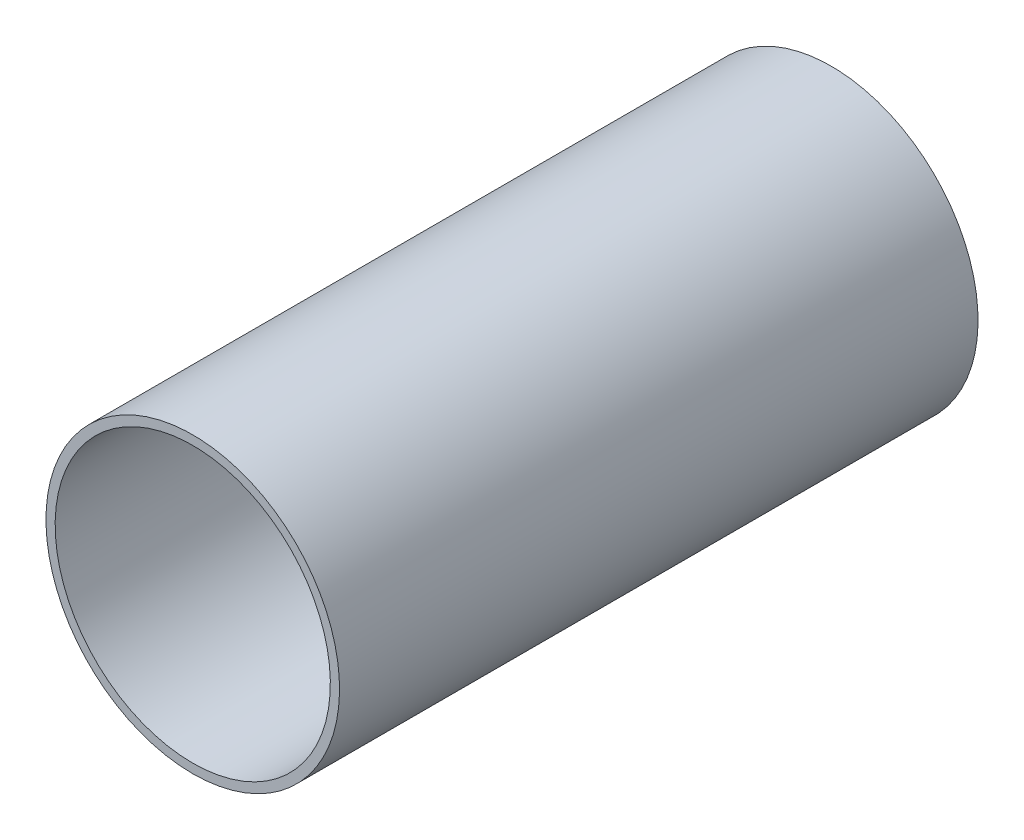
ISO-10303-21;
HEADER;
FILE_DESCRIPTION(('STEP AP214'),'2;1');
FILE_NAME('part.step','',(''),(''),'','','');
FILE_SCHEMA(('AUTOMOTIVE_DESIGN { 1 0 10303 214 1 1 1 1 }'));
ENDSEC;
DATA;
#1=APPLICATION_CONTEXT('core data for automotive mechanical design processes');
#2=APPLICATION_PROTOCOL_DEFINITION('international standard','automotive_design',2000,#1);
#3=PRODUCT_CONTEXT('',#1,'mechanical');
#4=PRODUCT('Part','Part','',(#3));
#5=PRODUCT_RELATED_PRODUCT_CATEGORY('part','',(#4));
#6=PRODUCT_DEFINITION_FORMATION('','',#4);
#7=PRODUCT_DEFINITION_CONTEXT('part definition',#1,'design');
#8=PRODUCT_DEFINITION('design','',#6,#7);
#9=PRODUCT_DEFINITION_SHAPE('','',#8);
#10=(LENGTH_UNIT() NAMED_UNIT(*) SI_UNIT(.MILLI.,.METRE.));
#11=(NAMED_UNIT(*) PLANE_ANGLE_UNIT() SI_UNIT($,.RADIAN.));
#12=(NAMED_UNIT(*) SI_UNIT($,.STERADIAN.) SOLID_ANGLE_UNIT());
#13=UNCERTAINTY_MEASURE_WITH_UNIT(LENGTH_MEASURE(1.E-05),#10,'distance_accuracy_value','');
#14=(GEOMETRIC_REPRESENTATION_CONTEXT(3) GLOBAL_UNCERTAINTY_ASSIGNED_CONTEXT((#13)) GLOBAL_UNIT_ASSIGNED_CONTEXT((#10,
#11,#12)) REPRESENTATION_CONTEXT('',''));
#15=CARTESIAN_POINT('',(0.,0.,0.));
#16=DIRECTION('',(0.,0.,1.));
#17=DIRECTION('',(1.,0.,0.));
#18=AXIS2_PLACEMENT_3D('',#15,#16,#17);
#19=CARTESIAN_POINT('',(137.16,-80.772,-0.045));
#20=DIRECTION('',(0.,0.,-1.));
#21=DIRECTION('',(0.,-1.,0.));
#22=AXIS2_PLACEMENT_3D('',#19,#20,#21);
#23=CYLINDRICAL_SURFACE('',#22,0.375);
#24=CARTESIAN_POINT('',(137.16,-80.772,-0.035));
#25=DIRECTION('',(0.,0.,-1.));
#26=DIRECTION('',(0.,-1.,0.));
#27=AXIS2_PLACEMENT_3D('',#24,#25,#26);
#28=CIRCLE('',#27,0.375);
#29=CARTESIAN_POINT('',(137.16,-81.147,-0.035));
#30=VERTEX_POINT('',#29);
#31=EDGE_CURVE('E54',#30,#30,#28,.T.);
#32=ORIENTED_EDGE('',*,*,#31,.T.);
#33=DIRECTION('',(0.,0.,1.));
#34=VECTOR('',#33,1.);
#35=CARTESIAN_POINT('',(137.16,-81.147,-0.045));
#36=LINE('',#35,#34);
#37=CARTESIAN_POINT('',(137.16,-81.147,1.705));
#38=VERTEX_POINT('',#37);
#39=EDGE_CURVE('E11',#30,#38,#36,.T.);
#40=ORIENTED_EDGE('',*,*,#39,.T.);
#41=CARTESIAN_POINT('',(137.16,-80.772,1.705));
#42=DIRECTION('',(0.,0.,-1.));
#43=DIRECTION('',(0.,-1.,0.));
#44=AXIS2_PLACEMENT_3D('',#41,#42,#43);
#45=CIRCLE('',#44,0.375);
#46=EDGE_CURVE('E21',#38,#38,#45,.T.);
#47=ORIENTED_EDGE('',*,*,#46,.F.);
#48=ORIENTED_EDGE('',*,*,#39,.F.);
#49=EDGE_LOOP('',(#32,#40,#47,#48));
#50=FACE_BOUND('',#49,.T.);
#51=ADVANCED_FACE('F17',(#50),#23,.F.);
#52=CARTESIAN_POINT('',(137.16,-81.172,1.705));
#53=DIRECTION('',(0.,0.,1.));
#54=DIRECTION('',(1.,0.,0.));
#55=AXIS2_PLACEMENT_3D('',#52,#53,#54);
#56=PLANE('',#55);
#57=ORIENTED_EDGE('',*,*,#46,.T.);
#58=EDGE_LOOP('',(#57));
#59=FACE_BOUND('',#58,.T.);
#60=CARTESIAN_POINT('',(137.16,-80.772,1.705));
#61=DIRECTION('',(0.,0.,1.));
#62=DIRECTION('',(0.,-1.,0.));
#63=AXIS2_PLACEMENT_3D('',#60,#61,#62);
#64=CIRCLE('',#63,0.4);
#65=CARTESIAN_POINT('',(137.16,-81.172,1.705));
#66=VERTEX_POINT('',#65);
#67=EDGE_CURVE('E50',#66,#66,#64,.T.);
#68=ORIENTED_EDGE('',*,*,#67,.T.);
#69=EDGE_LOOP('',(#68));
#70=FACE_BOUND('',#69,.T.);
#71=ADVANCED_FACE('F19',(#59,#70),#56,.T.);
#72=CARTESIAN_POINT('',(137.16,-81.172,-0.035));
#73=DIRECTION('',(0.,0.,1.));
#74=DIRECTION('',(1.,0.,0.));
#75=AXIS2_PLACEMENT_3D('',#72,#73,#74);
#76=PLANE('',#75);
#77=ORIENTED_EDGE('',*,*,#31,.F.);
#78=EDGE_LOOP('',(#77));
#79=FACE_BOUND('',#78,.T.);
#80=CARTESIAN_POINT('',(137.16,-80.772,-0.035));
#81=DIRECTION('',(0.,0.,1.));
#82=DIRECTION('',(0.,-1.,0.));
#83=AXIS2_PLACEMENT_3D('',#80,#81,#82);
#84=CIRCLE('',#83,0.4);
#85=CARTESIAN_POINT('',(137.16,-81.172,-0.035));
#86=VERTEX_POINT('',#85);
#87=EDGE_CURVE('E62',#86,#86,#84,.T.);
#88=ORIENTED_EDGE('',*,*,#87,.F.);
#89=EDGE_LOOP('',(#88));
#90=FACE_BOUND('',#89,.T.);
#91=ADVANCED_FACE('F72',(#79,#90),#76,.F.);
#92=CARTESIAN_POINT('',(137.16,-80.772,-0.035));
#93=DIRECTION('',(0.,0.,-1.));
#94=DIRECTION('',(0.,-1.,0.));
#95=AXIS2_PLACEMENT_3D('',#92,#93,#94);
#96=CYLINDRICAL_SURFACE('',#95,0.4);
#97=ORIENTED_EDGE('',*,*,#87,.T.);
#98=DIRECTION('',(0.,0.,1.));
#99=VECTOR('',#98,1.);
#100=CARTESIAN_POINT('',(137.16,-81.172,-0.035));
#101=LINE('',#100,#99);
#102=EDGE_CURVE('E55',#86,#66,#101,.T.);
#103=ORIENTED_EDGE('',*,*,#102,.T.);
#104=ORIENTED_EDGE('',*,*,#67,.F.);
#105=ORIENTED_EDGE('',*,*,#102,.F.);
#106=EDGE_LOOP('',(#97,#103,#104,#105));
#107=FACE_BOUND('',#106,.T.);
#108=ADVANCED_FACE('F70',(#107),#96,.T.);
#109=CLOSED_SHELL('',(#51,#71,#91,#108));
#110=MANIFOLD_SOLID_BREP('B1',#109);
#111=ADVANCED_BREP_SHAPE_REPRESENTATION('',(#18,#110),#14);
#112=SHAPE_DEFINITION_REPRESENTATION(#9,#111);
ENDSEC;
END-ISO-10303-21;
